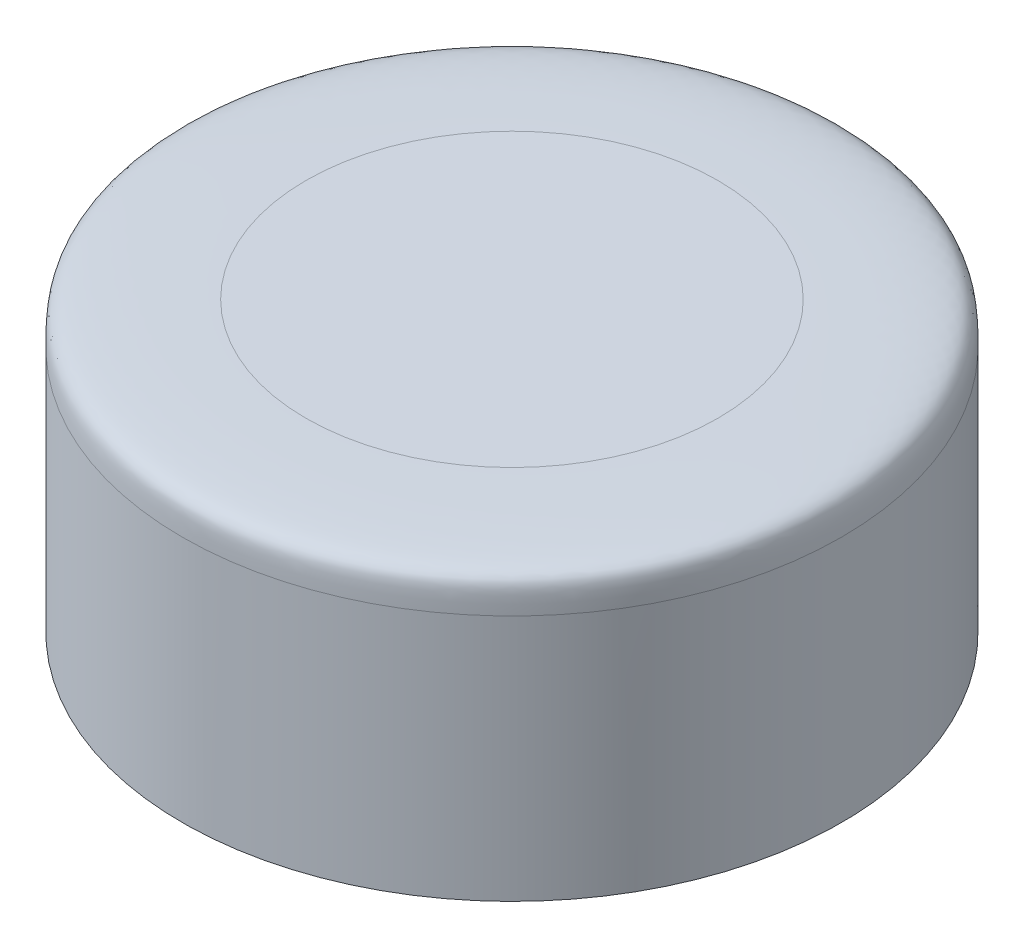
ISO-10303-21;
HEADER;
FILE_DESCRIPTION(('STEP AP214'),'2;1');
FILE_NAME('part.step','',(''),(''),'','','');
FILE_SCHEMA(('AUTOMOTIVE_DESIGN { 1 0 10303 214 1 1 1 1 }'));
ENDSEC;
DATA;
#1=APPLICATION_CONTEXT('core data for automotive mechanical design processes');
#2=APPLICATION_PROTOCOL_DEFINITION('international standard','automotive_design',2000,#1);
#3=PRODUCT_CONTEXT('',#1,'mechanical');
#4=PRODUCT('Part','Part','',(#3));
#5=PRODUCT_RELATED_PRODUCT_CATEGORY('part','',(#4));
#6=PRODUCT_DEFINITION_FORMATION('','',#4);
#7=PRODUCT_DEFINITION_CONTEXT('part definition',#1,'design');
#8=PRODUCT_DEFINITION('design','',#6,#7);
#9=PRODUCT_DEFINITION_SHAPE('','',#8);
#10=(LENGTH_UNIT() NAMED_UNIT(*) SI_UNIT(.MILLI.,.METRE.));
#11=(NAMED_UNIT(*) PLANE_ANGLE_UNIT() SI_UNIT($,.RADIAN.));
#12=(NAMED_UNIT(*) SI_UNIT($,.STERADIAN.) SOLID_ANGLE_UNIT());
#13=UNCERTAINTY_MEASURE_WITH_UNIT(LENGTH_MEASURE(1.E-05),#10,'distance_accuracy_value','');
#14=(GEOMETRIC_REPRESENTATION_CONTEXT(3) GLOBAL_UNCERTAINTY_ASSIGNED_CONTEXT((#13)) GLOBAL_UNIT_ASSIGNED_CONTEXT((#10,
#11,#12)) REPRESENTATION_CONTEXT('',''));
#15=CARTESIAN_POINT('',(0.,0.,0.));
#16=DIRECTION('',(0.,0.,1.));
#17=DIRECTION('',(1.,0.,0.));
#18=AXIS2_PLACEMENT_3D('',#15,#16,#17);
#19=CARTESIAN_POINT('',(0.,8.,0.));
#20=DIRECTION('',(0.,1.,0.));
#21=DIRECTION('',(-1.,0.,0.));
#22=AXIS2_PLACEMENT_3D('',#19,#20,#21);
#23=CYLINDRICAL_SURFACE('',#22,8.);
#24=CARTESIAN_POINT('',(0.,0.999999999999998,0.));
#25=DIRECTION('',(0.,1.,0.));
#26=DIRECTION('',(-1.,0.,0.));
#27=AXIS2_PLACEMENT_3D('',#24,#25,#26);
#28=CIRCLE('',#27,8.);
#29=CARTESIAN_POINT('',(-8.,0.999999999999997,0.));
#30=VERTEX_POINT('',#29);
#31=EDGE_CURVE('E45',#30,#30,#28,.T.);
#32=ORIENTED_EDGE('',*,*,#31,.T.);
#33=EDGE_LOOP('',(#32));
#34=FACE_BOUND('',#33,.T.);
#35=CARTESIAN_POINT('',(0.,7.,0.));
#36=DIRECTION('',(0.,1.,0.));
#37=DIRECTION('',(0.,0.,1.));
#38=AXIS2_PLACEMENT_3D('',#35,#36,#37);
#39=CIRCLE('',#38,8.);
#40=CARTESIAN_POINT('',(0.,7.,8.));
#41=VERTEX_POINT('',#40);
#42=EDGE_CURVE('E65',#41,#41,#39,.T.);
#43=ORIENTED_EDGE('',*,*,#42,.F.);
#44=EDGE_LOOP('',(#43));
#45=FACE_BOUND('',#44,.T.);
#46=ADVANCED_FACE('F37',(#34,#45),#23,.T.);
#47=CARTESIAN_POINT('',(0.,8.,0.));
#48=DIRECTION('',(0.,1.,0.));
#49=DIRECTION('',(-1.,0.,0.));
#50=AXIS2_PLACEMENT_3D('',#47,#48,#49);
#51=CYLINDRICAL_SURFACE('',#50,2.9);
#52=CARTESIAN_POINT('',(0.,0.399999999999998,0.));
#53=DIRECTION('',(0.,1.,0.));
#54=DIRECTION('',(-1.,0.,0.));
#55=AXIS2_PLACEMENT_3D('',#52,#53,#54);
#56=CIRCLE('',#55,2.9);
#57=CARTESIAN_POINT('',(-2.9,0.399999999999998,0.));
#58=VERTEX_POINT('',#57);
#59=EDGE_CURVE('E61',#58,#58,#56,.T.);
#60=ORIENTED_EDGE('',*,*,#59,.F.);
#61=EDGE_LOOP('',(#60));
#62=FACE_BOUND('',#61,.T.);
#63=CARTESIAN_POINT('',(0.,5.4,0.));
#64=DIRECTION('',(0.,1.,0.));
#65=DIRECTION('',(-1.,0.,0.));
#66=AXIS2_PLACEMENT_3D('',#63,#64,#65);
#67=CIRCLE('',#66,2.9);
#68=CARTESIAN_POINT('',(-2.9,5.4,0.));
#69=VERTEX_POINT('',#68);
#70=EDGE_CURVE('E10',#69,#69,#67,.T.);
#71=ORIENTED_EDGE('',*,*,#70,.T.);
#72=EDGE_LOOP('',(#71));
#73=FACE_BOUND('',#72,.T.);
#74=ADVANCED_FACE('F39',(#62,#73),#51,.F.);
#75=CARTESIAN_POINT('',(0.,5.4,0.));
#76=DIRECTION('',(0.,1.,0.));
#77=DIRECTION('',(-1.,0.,0.));
#78=AXIS2_PLACEMENT_3D('',#75,#76,#77);
#79=PLANE('',#78);
#80=ORIENTED_EDGE('',*,*,#70,.F.);
#81=EDGE_LOOP('',(#80));
#82=FACE_BOUND('',#81,.T.);
#83=ADVANCED_FACE('F96',(#82),#79,.F.);
#84=CARTESIAN_POINT('',(8.,1.,0.));
#85=DIRECTION('',(0.,1.,0.));
#86=DIRECTION('',(-1.,0.,0.));
#87=AXIS2_PLACEMENT_3D('',#84,#85,#86);
#88=PLANE('',#87);
#89=ORIENTED_EDGE('',*,*,#31,.F.);
#90=EDGE_LOOP('',(#89));
#91=FACE_BOUND('',#90,.T.);
#92=CARTESIAN_POINT('',(0.,0.999999999999998,0.));
#93=DIRECTION('',(0.,1.,0.));
#94=DIRECTION('',(-1.,0.,0.));
#95=AXIS2_PLACEMENT_3D('',#92,#93,#94);
#96=CIRCLE('',#95,3.9);
#97=CARTESIAN_POINT('',(-3.9,0.999999999999998,0.));
#98=VERTEX_POINT('',#97);
#99=EDGE_CURVE('E50',#98,#98,#96,.T.);
#100=ORIENTED_EDGE('',*,*,#99,.T.);
#101=EDGE_LOOP('',(#100));
#102=FACE_BOUND('',#101,.T.);
#103=ADVANCED_FACE('F92',(#91,#102),#88,.F.);
#104=CARTESIAN_POINT('',(0.,8.,0.));
#105=DIRECTION('',(0.,1.,0.));
#106=DIRECTION('',(-1.,0.,0.));
#107=AXIS2_PLACEMENT_3D('',#104,#105,#106);
#108=CYLINDRICAL_SURFACE('',#107,3.9);
#109=ORIENTED_EDGE('',*,*,#99,.F.);
#110=EDGE_LOOP('',(#109));
#111=FACE_BOUND('',#110,.T.);
#112=CARTESIAN_POINT('',(0.,0.399999999999998,0.));
#113=DIRECTION('',(0.,1.,0.));
#114=DIRECTION('',(-1.,0.,0.));
#115=AXIS2_PLACEMENT_3D('',#112,#113,#114);
#116=CIRCLE('',#115,3.9);
#117=CARTESIAN_POINT('',(-3.9,0.399999999999998,0.));
#118=VERTEX_POINT('',#117);
#119=EDGE_CURVE('E55',#118,#118,#116,.T.);
#120=ORIENTED_EDGE('',*,*,#119,.T.);
#121=EDGE_LOOP('',(#120));
#122=FACE_BOUND('',#121,.T.);
#123=ADVANCED_FACE('F88',(#111,#122),#108,.T.);
#124=CARTESIAN_POINT('',(3.9,0.399999999999999,0.));
#125=DIRECTION('',(0.,1.,0.));
#126=DIRECTION('',(-1.,0.,0.));
#127=AXIS2_PLACEMENT_3D('',#124,#125,#126);
#128=PLANE('',#127);
#129=ORIENTED_EDGE('',*,*,#119,.F.);
#130=EDGE_LOOP('',(#129));
#131=FACE_BOUND('',#130,.T.);
#132=ORIENTED_EDGE('',*,*,#59,.T.);
#133=EDGE_LOOP('',(#132));
#134=FACE_BOUND('',#133,.T.);
#135=ADVANCED_FACE('F84',(#131,#134),#128,.F.);
#136=CARTESIAN_POINT('',(5.,8.,0.));
#137=CARTESIAN_POINT('',(5.69348885891003,8.,0.));
#138=CARTESIAN_POINT('',(7.46489378734308,7.9800070985888,0.));
#139=CARTESIAN_POINT('',(7.98974021066399,7.7047141414549,0.));
#140=CARTESIAN_POINT('',(8.,7.51540736754786,0.));
#141=CARTESIAN_POINT('',(8.,6.99999999999999,0.));
#142=B_SPLINE_CURVE_WITH_KNOTS('',3,(#136,#137,#138,#139,#140,#141),.UNSPECIFIED.,.F.,.F.,(4,1,
1,4),(0.,0.505788059801802,0.605788059801802,1.),.UNSPECIFIED.);
#143=CARTESIAN_POINT('',(0.,0.,0.));
#144=DIRECTION('',(0.,1.,0.));
#145=AXIS1_PLACEMENT('',#143,#144);
#146=SURFACE_OF_REVOLUTION('',#142,#145);
#147=ORIENTED_EDGE('',*,*,#42,.T.);
#148=EDGE_LOOP('',(#147));
#149=FACE_BOUND('',#148,.T.);
#150=CARTESIAN_POINT('',(0.,8.,0.));
#151=DIRECTION('',(0.,1.,0.));
#152=DIRECTION('',(0.,0.,1.));
#153=AXIS2_PLACEMENT_3D('',#150,#151,#152);
#154=CIRCLE('',#153,5.);
#155=CARTESIAN_POINT('',(0.,8.,5.));
#156=VERTEX_POINT('',#155);
#157=EDGE_CURVE('E69',#156,#156,#154,.T.);
#158=ORIENTED_EDGE('',*,*,#157,.F.);
#159=EDGE_LOOP('',(#158));
#160=FACE_BOUND('',#159,.T.);
#161=ADVANCED_FACE('F80',(#149,#160),#146,.F.);
#162=CARTESIAN_POINT('',(0.,8.,0.));
#163=DIRECTION('',(0.,-1.,0.));
#164=DIRECTION('',(1.,0.,0.));
#165=AXIS2_PLACEMENT_3D('',#162,#163,#164);
#166=PLANE('',#165);
#167=ORIENTED_EDGE('',*,*,#157,.T.);
#168=EDGE_LOOP('',(#167));
#169=FACE_BOUND('',#168,.T.);
#170=ADVANCED_FACE('F83',(#169),#166,.F.);
#171=CLOSED_SHELL('',(#46,#74,#83,#103,#123,#135,#161,#170));
#172=MANIFOLD_SOLID_BREP('B2',#171);
#173=ADVANCED_BREP_SHAPE_REPRESENTATION('',(#18,#172),#14);
#174=SHAPE_DEFINITION_REPRESENTATION(#9,#173);
ENDSEC;
END-ISO-10303-21;
